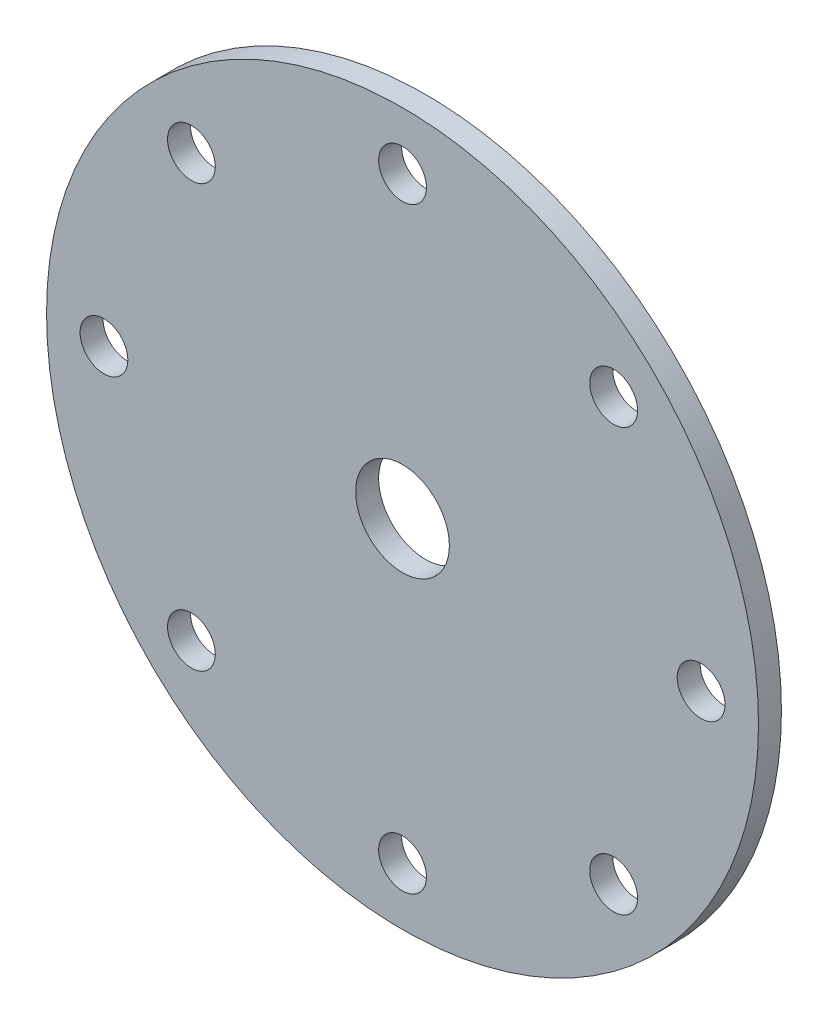
ISO-10303-21;
HEADER;
FILE_DESCRIPTION(('STEP AP214'),'2;1');
FILE_NAME('part.step','',(''),(''),'','','');
FILE_SCHEMA(('AUTOMOTIVE_DESIGN { 1 0 10303 214 1 1 1 1 }'));
ENDSEC;
DATA;
#1=APPLICATION_CONTEXT('core data for automotive mechanical design processes');
#2=APPLICATION_PROTOCOL_DEFINITION('international standard','automotive_design',2000,#1);
#3=PRODUCT_CONTEXT('',#1,'mechanical');
#4=PRODUCT('Part','Part','',(#3));
#5=PRODUCT_RELATED_PRODUCT_CATEGORY('part','',(#4));
#6=PRODUCT_DEFINITION_FORMATION('','',#4);
#7=PRODUCT_DEFINITION_CONTEXT('part definition',#1,'design');
#8=PRODUCT_DEFINITION('design','',#6,#7);
#9=PRODUCT_DEFINITION_SHAPE('','',#8);
#10=(LENGTH_UNIT() NAMED_UNIT(*) SI_UNIT(.MILLI.,.METRE.));
#11=(NAMED_UNIT(*) PLANE_ANGLE_UNIT() SI_UNIT($,.RADIAN.));
#12=(NAMED_UNIT(*) SI_UNIT($,.STERADIAN.) SOLID_ANGLE_UNIT());
#13=UNCERTAINTY_MEASURE_WITH_UNIT(LENGTH_MEASURE(1.E-05),#10,'distance_accuracy_value','');
#14=(GEOMETRIC_REPRESENTATION_CONTEXT(3) GLOBAL_UNCERTAINTY_ASSIGNED_CONTEXT((#13)) GLOBAL_UNIT_ASSIGNED_CONTEXT((#10,
#11,#12)) REPRESENTATION_CONTEXT('',''));
#15=CARTESIAN_POINT('',(0.,0.,0.));
#16=DIRECTION('',(0.,0.,1.));
#17=DIRECTION('',(1.,0.,0.));
#18=AXIS2_PLACEMENT_3D('',#15,#16,#17);
#19=CARTESIAN_POINT('',(0.,0.,6.35));
#20=DIRECTION('',(0.,0.,-1.));
#21=DIRECTION('',(-1.,0.,0.));
#22=AXIS2_PLACEMENT_3D('',#19,#20,#21);
#23=CYLINDRICAL_SURFACE('',#22,12.954);
#24=CARTESIAN_POINT('',(0.,0.,6.35));
#25=DIRECTION('',(0.,0.,1.));
#26=DIRECTION('',(1.,0.,0.));
#27=AXIS2_PLACEMENT_3D('',#24,#25,#26);
#28=CIRCLE('',#27,12.954);
#29=CARTESIAN_POINT('',(12.954,0.,6.35));
#30=VERTEX_POINT('',#29);
#31=EDGE_CURVE('E48',#30,#30,#28,.T.);
#32=ORIENTED_EDGE('',*,*,#31,.T.);
#33=EDGE_LOOP('',(#32));
#34=FACE_BOUND('',#33,.T.);
#35=CARTESIAN_POINT('',(0.,0.,0.));
#36=DIRECTION('',(0.,0.,1.));
#37=DIRECTION('',(1.,0.,0.));
#38=AXIS2_PLACEMENT_3D('',#35,#36,#37);
#39=CIRCLE('',#38,12.954);
#40=CARTESIAN_POINT('',(12.954,0.,0.));
#41=VERTEX_POINT('',#40);
#42=EDGE_CURVE('E89',#41,#41,#39,.T.);
#43=ORIENTED_EDGE('',*,*,#42,.F.);
#44=EDGE_LOOP('',(#43));
#45=FACE_BOUND('',#44,.T.);
#46=ADVANCED_FACE('F39',(#34,#45),#23,.F.);
#47=CARTESIAN_POINT('',(0.,82.55,6.35));
#48=DIRECTION('',(0.,0.,-1.));
#49=DIRECTION('',(-1.,0.,0.));
#50=AXIS2_PLACEMENT_3D('',#47,#48,#49);
#51=CYLINDRICAL_SURFACE('',#50,6.604);
#52=CARTESIAN_POINT('',(0.,82.55,6.35));
#53=DIRECTION('',(0.,0.,1.));
#54=DIRECTION('',(1.,0.,0.));
#55=AXIS2_PLACEMENT_3D('',#52,#53,#54);
#56=CIRCLE('',#55,6.604);
#57=CARTESIAN_POINT('',(6.604,82.55,6.35));
#58=VERTEX_POINT('',#57);
#59=EDGE_CURVE('E54',#58,#58,#56,.T.);
#60=ORIENTED_EDGE('',*,*,#59,.T.);
#61=EDGE_LOOP('',(#60));
#62=FACE_BOUND('',#61,.T.);
#63=CARTESIAN_POINT('',(0.,82.55,0.));
#64=DIRECTION('',(0.,0.,1.));
#65=DIRECTION('',(1.,0.,0.));
#66=AXIS2_PLACEMENT_3D('',#63,#64,#65);
#67=CIRCLE('',#66,6.604);
#68=CARTESIAN_POINT('',(6.604,82.55,0.));
#69=VERTEX_POINT('',#68);
#70=EDGE_CURVE('E86',#69,#69,#67,.T.);
#71=ORIENTED_EDGE('',*,*,#70,.F.);
#72=EDGE_LOOP('',(#71));
#73=FACE_BOUND('',#72,.T.);
#74=ADVANCED_FACE('F132',(#62,#73),#51,.F.);
#75=CARTESIAN_POINT('',(58.3716647869495,58.3716647869495,6.35));
#76=DIRECTION('',(0.,0.,-1.));
#77=DIRECTION('',(-1.,0.,0.));
#78=AXIS2_PLACEMENT_3D('',#75,#76,#77);
#79=CYLINDRICAL_SURFACE('',#78,6.604);
#80=CARTESIAN_POINT('',(58.3716647869495,58.3716647869495,6.35));
#81=DIRECTION('',(0.,0.,1.));
#82=DIRECTION('',(1.,0.,0.));
#83=AXIS2_PLACEMENT_3D('',#80,#81,#82);
#84=CIRCLE('',#83,6.604);
#85=CARTESIAN_POINT('',(64.9756647869495,58.3716647869495,6.35));
#86=VERTEX_POINT('',#85);
#87=EDGE_CURVE('E125',#86,#86,#84,.T.);
#88=ORIENTED_EDGE('',*,*,#87,.T.);
#89=EDGE_LOOP('',(#88));
#90=FACE_BOUND('',#89,.T.);
#91=CARTESIAN_POINT('',(58.3716647869495,58.3716647869495,0.));
#92=DIRECTION('',(0.,0.,1.));
#93=DIRECTION('',(1.,0.,0.));
#94=AXIS2_PLACEMENT_3D('',#91,#92,#93);
#95=CIRCLE('',#94,6.604);
#96=CARTESIAN_POINT('',(64.9756647869495,58.3716647869495,0.));
#97=VERTEX_POINT('',#96);
#98=EDGE_CURVE('E82',#97,#97,#95,.T.);
#99=ORIENTED_EDGE('',*,*,#98,.F.);
#100=EDGE_LOOP('',(#99));
#101=FACE_BOUND('',#100,.T.);
#102=ADVANCED_FACE('F150',(#90,#101),#79,.F.);
#103=CARTESIAN_POINT('',(82.55,0.,6.35));
#104=DIRECTION('',(0.,0.,-1.));
#105=DIRECTION('',(-1.,0.,0.));
#106=AXIS2_PLACEMENT_3D('',#103,#104,#105);
#107=CYLINDRICAL_SURFACE('',#106,6.604);
#108=CARTESIAN_POINT('',(82.55,0.,6.35));
#109=DIRECTION('',(0.,0.,1.));
#110=DIRECTION('',(1.,0.,0.));
#111=AXIS2_PLACEMENT_3D('',#108,#109,#110);
#112=CIRCLE('',#111,6.604);
#113=CARTESIAN_POINT('',(89.154,0.,6.35));
#114=VERTEX_POINT('',#113);
#115=EDGE_CURVE('E121',#114,#114,#112,.T.);
#116=ORIENTED_EDGE('',*,*,#115,.T.);
#117=EDGE_LOOP('',(#116));
#118=FACE_BOUND('',#117,.T.);
#119=CARTESIAN_POINT('',(82.55,0.,0.));
#120=DIRECTION('',(0.,0.,1.));
#121=DIRECTION('',(1.,0.,0.));
#122=AXIS2_PLACEMENT_3D('',#119,#120,#121);
#123=CIRCLE('',#122,6.604);
#124=CARTESIAN_POINT('',(89.154,0.,0.));
#125=VERTEX_POINT('',#124);
#126=EDGE_CURVE('E78',#125,#125,#123,.T.);
#127=ORIENTED_EDGE('',*,*,#126,.F.);
#128=EDGE_LOOP('',(#127));
#129=FACE_BOUND('',#128,.T.);
#130=ADVANCED_FACE('F157',(#118,#129),#107,.F.);
#131=CARTESIAN_POINT('',(58.3716647869495,-58.3716647869495,6.35));
#132=DIRECTION('',(0.,0.,-1.));
#133=DIRECTION('',(-1.,0.,0.));
#134=AXIS2_PLACEMENT_3D('',#131,#132,#133);
#135=CYLINDRICAL_SURFACE('',#134,6.604);
#136=CARTESIAN_POINT('',(58.3716647869495,-58.3716647869495,6.35));
#137=DIRECTION('',(0.,0.,1.));
#138=DIRECTION('',(1.,0.,0.));
#139=AXIS2_PLACEMENT_3D('',#136,#137,#138);
#140=CIRCLE('',#139,6.604);
#141=CARTESIAN_POINT('',(64.9756647869495,-58.3716647869495,6.35));
#142=VERTEX_POINT('',#141);
#143=EDGE_CURVE('E117',#142,#142,#140,.T.);
#144=ORIENTED_EDGE('',*,*,#143,.T.);
#145=EDGE_LOOP('',(#144));
#146=FACE_BOUND('',#145,.T.);
#147=CARTESIAN_POINT('',(58.3716647869495,-58.3716647869495,0.));
#148=DIRECTION('',(0.,0.,1.));
#149=DIRECTION('',(1.,0.,0.));
#150=AXIS2_PLACEMENT_3D('',#147,#148,#149);
#151=CIRCLE('',#150,6.604);
#152=CARTESIAN_POINT('',(64.9756647869495,-58.3716647869495,0.));
#153=VERTEX_POINT('',#152);
#154=EDGE_CURVE('E74',#153,#153,#151,.T.);
#155=ORIENTED_EDGE('',*,*,#154,.F.);
#156=EDGE_LOOP('',(#155));
#157=FACE_BOUND('',#156,.T.);
#158=ADVANCED_FACE('F161',(#146,#157),#135,.F.);
#159=CARTESIAN_POINT('',(0.,-82.55,6.35));
#160=DIRECTION('',(0.,0.,-1.));
#161=DIRECTION('',(-1.,0.,0.));
#162=AXIS2_PLACEMENT_3D('',#159,#160,#161);
#163=CYLINDRICAL_SURFACE('',#162,6.604);
#164=CARTESIAN_POINT('',(0.,-82.55,6.35));
#165=DIRECTION('',(0.,0.,1.));
#166=DIRECTION('',(1.,0.,0.));
#167=AXIS2_PLACEMENT_3D('',#164,#165,#166);
#168=CIRCLE('',#167,6.604);
#169=CARTESIAN_POINT('',(6.60400000000002,-82.55,6.35));
#170=VERTEX_POINT('',#169);
#171=EDGE_CURVE('E113',#170,#170,#168,.T.);
#172=ORIENTED_EDGE('',*,*,#171,.T.);
#173=EDGE_LOOP('',(#172));
#174=FACE_BOUND('',#173,.T.);
#175=CARTESIAN_POINT('',(0.,-82.55,0.));
#176=DIRECTION('',(0.,0.,1.));
#177=DIRECTION('',(1.,0.,0.));
#178=AXIS2_PLACEMENT_3D('',#175,#176,#177);
#179=CIRCLE('',#178,6.604);
#180=CARTESIAN_POINT('',(6.60400000000002,-82.55,0.));
#181=VERTEX_POINT('',#180);
#182=EDGE_CURVE('E70',#181,#181,#179,.T.);
#183=ORIENTED_EDGE('',*,*,#182,.F.);
#184=EDGE_LOOP('',(#183));
#185=FACE_BOUND('',#184,.T.);
#186=ADVANCED_FACE('F165',(#174,#185),#163,.F.);
#187=CARTESIAN_POINT('',(-58.3716647869495,-58.3716647869495,6.35));
#188=DIRECTION('',(0.,0.,-1.));
#189=DIRECTION('',(-1.,0.,0.));
#190=AXIS2_PLACEMENT_3D('',#187,#188,#189);
#191=CYLINDRICAL_SURFACE('',#190,6.604);
#192=CARTESIAN_POINT('',(-58.3716647869495,-58.3716647869495,6.35));
#193=DIRECTION('',(0.,0.,1.));
#194=DIRECTION('',(1.,0.,0.));
#195=AXIS2_PLACEMENT_3D('',#192,#193,#194);
#196=CIRCLE('',#195,6.604);
#197=CARTESIAN_POINT('',(-51.7676647869495,-58.3716647869495,6.35));
#198=VERTEX_POINT('',#197);
#199=EDGE_CURVE('E107',#198,#198,#196,.T.);
#200=ORIENTED_EDGE('',*,*,#199,.T.);
#201=EDGE_LOOP('',(#200));
#202=FACE_BOUND('',#201,.T.);
#203=CARTESIAN_POINT('',(-58.3716647869495,-58.3716647869495,0.));
#204=DIRECTION('',(0.,0.,1.));
#205=DIRECTION('',(1.,0.,0.));
#206=AXIS2_PLACEMENT_3D('',#203,#204,#205);
#207=CIRCLE('',#206,6.604);
#208=CARTESIAN_POINT('',(-51.7676647869495,-58.3716647869495,0.));
#209=VERTEX_POINT('',#208);
#210=EDGE_CURVE('E66',#209,#209,#207,.T.);
#211=ORIENTED_EDGE('',*,*,#210,.F.);
#212=EDGE_LOOP('',(#211));
#213=FACE_BOUND('',#212,.T.);
#214=ADVANCED_FACE('F169',(#202,#213),#191,.F.);
#215=CARTESIAN_POINT('',(-82.55,0.,6.35));
#216=DIRECTION('',(0.,0.,-1.));
#217=DIRECTION('',(-1.,0.,0.));
#218=AXIS2_PLACEMENT_3D('',#215,#216,#217);
#219=CYLINDRICAL_SURFACE('',#218,6.604);
#220=CARTESIAN_POINT('',(-82.55,0.,6.35));
#221=DIRECTION('',(0.,0.,1.));
#222=DIRECTION('',(1.,0.,0.));
#223=AXIS2_PLACEMENT_3D('',#220,#221,#222);
#224=CIRCLE('',#223,6.604);
#225=CARTESIAN_POINT('',(-75.946,0.,6.35));
#226=VERTEX_POINT('',#225);
#227=EDGE_CURVE('E101',#226,#226,#224,.T.);
#228=ORIENTED_EDGE('',*,*,#227,.T.);
#229=EDGE_LOOP('',(#228));
#230=FACE_BOUND('',#229,.T.);
#231=CARTESIAN_POINT('',(-82.55,0.,0.));
#232=DIRECTION('',(0.,0.,1.));
#233=DIRECTION('',(1.,0.,0.));
#234=AXIS2_PLACEMENT_3D('',#231,#232,#233);
#235=CIRCLE('',#234,6.604);
#236=CARTESIAN_POINT('',(-75.946,0.,0.));
#237=VERTEX_POINT('',#236);
#238=EDGE_CURVE('E62',#237,#237,#235,.T.);
#239=ORIENTED_EDGE('',*,*,#238,.F.);
#240=EDGE_LOOP('',(#239));
#241=FACE_BOUND('',#240,.T.);
#242=ADVANCED_FACE('F172',(#230,#241),#219,.F.);
#243=CARTESIAN_POINT('',(-58.3716647869495,58.3716647869495,6.35));
#244=DIRECTION('',(0.,0.,-1.));
#245=DIRECTION('',(-1.,0.,0.));
#246=AXIS2_PLACEMENT_3D('',#243,#244,#245);
#247=CYLINDRICAL_SURFACE('',#246,6.604);
#248=CARTESIAN_POINT('',(-58.3716647869495,58.3716647869495,6.35));
#249=DIRECTION('',(0.,0.,1.));
#250=DIRECTION('',(1.,0.,0.));
#251=AXIS2_PLACEMENT_3D('',#248,#249,#250);
#252=CIRCLE('',#251,6.604);
#253=CARTESIAN_POINT('',(-51.7676647869495,58.3716647869495,6.35));
#254=VERTEX_POINT('',#253);
#255=EDGE_CURVE('E96',#254,#254,#252,.T.);
#256=ORIENTED_EDGE('',*,*,#255,.T.);
#257=EDGE_LOOP('',(#256));
#258=FACE_BOUND('',#257,.T.);
#259=CARTESIAN_POINT('',(-58.3716647869495,58.3716647869495,0.));
#260=DIRECTION('',(0.,0.,1.));
#261=DIRECTION('',(1.,0.,0.));
#262=AXIS2_PLACEMENT_3D('',#259,#260,#261);
#263=CIRCLE('',#262,6.604);
#264=CARTESIAN_POINT('',(-51.7676647869495,58.3716647869495,0.));
#265=VERTEX_POINT('',#264);
#266=EDGE_CURVE('E58',#265,#265,#263,.T.);
#267=ORIENTED_EDGE('',*,*,#266,.F.);
#268=EDGE_LOOP('',(#267));
#269=FACE_BOUND('',#268,.T.);
#270=ADVANCED_FACE('F41',(#258,#269),#247,.F.);
#271=CARTESIAN_POINT('',(0.,0.,6.35));
#272=DIRECTION('',(0.,0.,-1.));
#273=DIRECTION('',(-1.,0.,0.));
#274=AXIS2_PLACEMENT_3D('',#271,#272,#273);
#275=CYLINDRICAL_SURFACE('',#274,98.425);
#276=CARTESIAN_POINT('',(0.,0.,6.35));
#277=DIRECTION('',(0.,0.,1.));
#278=DIRECTION('',(1.,0.,0.));
#279=AXIS2_PLACEMENT_3D('',#276,#277,#278);
#280=CIRCLE('',#279,98.425);
#281=CARTESIAN_POINT('',(98.425,0.,6.35));
#282=VERTEX_POINT('',#281);
#283=EDGE_CURVE('E10',#282,#282,#280,.T.);
#284=ORIENTED_EDGE('',*,*,#283,.F.);
#285=EDGE_LOOP('',(#284));
#286=FACE_BOUND('',#285,.T.);
#287=CARTESIAN_POINT('',(0.,0.,0.));
#288=DIRECTION('',(0.,0.,1.));
#289=DIRECTION('',(1.,0.,0.));
#290=AXIS2_PLACEMENT_3D('',#287,#288,#289);
#291=CIRCLE('',#290,98.425);
#292=CARTESIAN_POINT('',(98.425,0.,0.));
#293=VERTEX_POINT('',#292);
#294=EDGE_CURVE('E43',#293,#293,#291,.T.);
#295=ORIENTED_EDGE('',*,*,#294,.T.);
#296=EDGE_LOOP('',(#295));
#297=FACE_BOUND('',#296,.T.);
#298=ADVANCED_FACE('F139',(#286,#297),#275,.T.);
#299=CARTESIAN_POINT('',(0.,0.,6.35));
#300=DIRECTION('',(0.,0.,1.));
#301=DIRECTION('',(1.,0.,0.));
#302=AXIS2_PLACEMENT_3D('',#299,#300,#301);
#303=PLANE('',#302);
#304=ORIENTED_EDGE('',*,*,#255,.F.);
#305=EDGE_LOOP('',(#304));
#306=FACE_BOUND('',#305,.T.);
#307=ORIENTED_EDGE('',*,*,#227,.F.);
#308=EDGE_LOOP('',(#307));
#309=FACE_BOUND('',#308,.T.);
#310=ORIENTED_EDGE('',*,*,#199,.F.);
#311=EDGE_LOOP('',(#310));
#312=FACE_BOUND('',#311,.T.);
#313=ORIENTED_EDGE('',*,*,#171,.F.);
#314=EDGE_LOOP('',(#313));
#315=FACE_BOUND('',#314,.T.);
#316=ORIENTED_EDGE('',*,*,#143,.F.);
#317=EDGE_LOOP('',(#316));
#318=FACE_BOUND('',#317,.T.);
#319=ORIENTED_EDGE('',*,*,#115,.F.);
#320=EDGE_LOOP('',(#319));
#321=FACE_BOUND('',#320,.T.);
#322=ORIENTED_EDGE('',*,*,#87,.F.);
#323=EDGE_LOOP('',(#322));
#324=FACE_BOUND('',#323,.T.);
#325=ORIENTED_EDGE('',*,*,#59,.F.);
#326=EDGE_LOOP('',(#325));
#327=FACE_BOUND('',#326,.T.);
#328=ORIENTED_EDGE('',*,*,#31,.F.);
#329=EDGE_LOOP('',(#328));
#330=FACE_BOUND('',#329,.T.);
#331=ORIENTED_EDGE('',*,*,#283,.T.);
#332=EDGE_LOOP('',(#331));
#333=FACE_BOUND('',#332,.T.);
#334=ADVANCED_FACE('F135',(#306,#309,#312,#315,#318,#321,#324,#327,#330,#333),#303,.T.);
#335=CARTESIAN_POINT('',(0.,0.,0.));
#336=DIRECTION('',(0.,0.,1.));
#337=DIRECTION('',(1.,0.,0.));
#338=AXIS2_PLACEMENT_3D('',#335,#336,#337);
#339=PLANE('',#338);
#340=ORIENTED_EDGE('',*,*,#266,.T.);
#341=EDGE_LOOP('',(#340));
#342=FACE_BOUND('',#341,.T.);
#343=ORIENTED_EDGE('',*,*,#238,.T.);
#344=EDGE_LOOP('',(#343));
#345=FACE_BOUND('',#344,.T.);
#346=ORIENTED_EDGE('',*,*,#210,.T.);
#347=EDGE_LOOP('',(#346));
#348=FACE_BOUND('',#347,.T.);
#349=ORIENTED_EDGE('',*,*,#182,.T.);
#350=EDGE_LOOP('',(#349));
#351=FACE_BOUND('',#350,.T.);
#352=ORIENTED_EDGE('',*,*,#154,.T.);
#353=EDGE_LOOP('',(#352));
#354=FACE_BOUND('',#353,.T.);
#355=ORIENTED_EDGE('',*,*,#126,.T.);
#356=EDGE_LOOP('',(#355));
#357=FACE_BOUND('',#356,.T.);
#358=ORIENTED_EDGE('',*,*,#98,.T.);
#359=EDGE_LOOP('',(#358));
#360=FACE_BOUND('',#359,.T.);
#361=ORIENTED_EDGE('',*,*,#70,.T.);
#362=EDGE_LOOP('',(#361));
#363=FACE_BOUND('',#362,.T.);
#364=ORIENTED_EDGE('',*,*,#42,.T.);
#365=EDGE_LOOP('',(#364));
#366=FACE_BOUND('',#365,.T.);
#367=ORIENTED_EDGE('',*,*,#294,.F.);
#368=EDGE_LOOP('',(#367));
#369=FACE_BOUND('',#368,.T.);
#370=ADVANCED_FACE('F138',(#342,#345,#348,#351,#354,#357,#360,#363,#366,#369),#339,.F.);
#371=CLOSED_SHELL('',(#46,#74,#102,#130,#158,#186,#214,#242,#270,#298,#334,#370));
#372=MANIFOLD_SOLID_BREP('B2',#371);
#373=ADVANCED_BREP_SHAPE_REPRESENTATION('',(#18,#372),#14);
#374=SHAPE_DEFINITION_REPRESENTATION(#9,#373);
ENDSEC;
END-ISO-10303-21;
